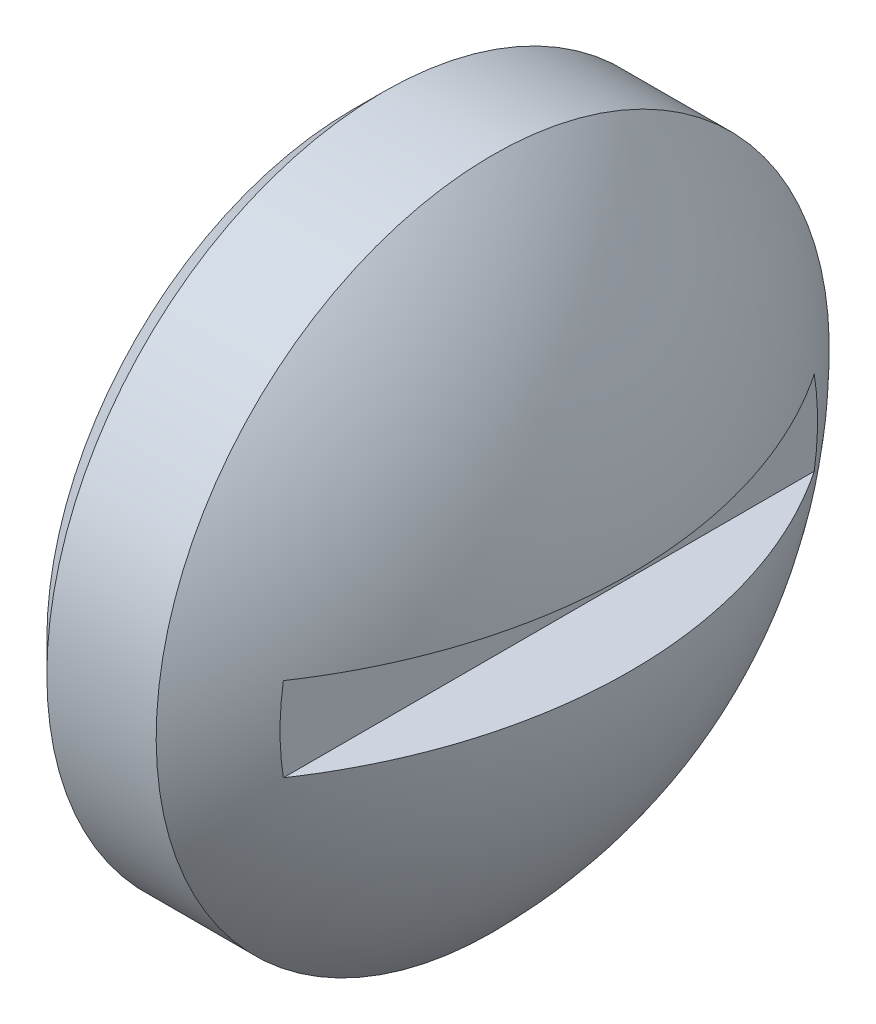
ISO-10303-21;
HEADER;
FILE_DESCRIPTION(('STEP AP214'),'2;1');
FILE_NAME('part.step','',(''),(''),'','','');
FILE_SCHEMA(('AUTOMOTIVE_DESIGN { 1 0 10303 214 1 1 1 1 }'));
ENDSEC;
DATA;
#1=APPLICATION_CONTEXT('core data for automotive mechanical design processes');
#2=APPLICATION_PROTOCOL_DEFINITION('international standard','automotive_design',2000,#1);
#3=PRODUCT_CONTEXT('',#1,'mechanical');
#4=PRODUCT('Part','Part','',(#3));
#5=PRODUCT_RELATED_PRODUCT_CATEGORY('part','',(#4));
#6=PRODUCT_DEFINITION_FORMATION('','',#4);
#7=PRODUCT_DEFINITION_CONTEXT('part definition',#1,'design');
#8=PRODUCT_DEFINITION('design','',#6,#7);
#9=PRODUCT_DEFINITION_SHAPE('','',#8);
#10=(LENGTH_UNIT() NAMED_UNIT(*) SI_UNIT(.MILLI.,.METRE.));
#11=(NAMED_UNIT(*) PLANE_ANGLE_UNIT() SI_UNIT($,.RADIAN.));
#12=(NAMED_UNIT(*) SI_UNIT($,.STERADIAN.) SOLID_ANGLE_UNIT());
#13=UNCERTAINTY_MEASURE_WITH_UNIT(LENGTH_MEASURE(1.E-05),#10,'distance_accuracy_value','');
#14=(GEOMETRIC_REPRESENTATION_CONTEXT(3) GLOBAL_UNCERTAINTY_ASSIGNED_CONTEXT((#13)) GLOBAL_UNIT_ASSIGNED_CONTEXT((#10,
#11,#12)) REPRESENTATION_CONTEXT('',''));
#15=CARTESIAN_POINT('',(0.,0.,0.));
#16=DIRECTION('',(0.,0.,1.));
#17=DIRECTION('',(1.,0.,0.));
#18=AXIS2_PLACEMENT_3D('',#15,#16,#17);
#19=CARTESIAN_POINT('',(-7.0415945787923,0.,0.));
#20=DIRECTION('',(-1.,0.,0.));
#21=DIRECTION('',(0.,1.,0.));
#22=AXIS2_PLACEMENT_3D('',#19,#20,#21);
#23=SPHERICAL_SURFACE('',#22,17.);
#24=CARTESIAN_POINT('',(5.,0.,0.));
#25=DIRECTION('',(-1.,0.,0.));
#26=DIRECTION('',(0.,-1.,0.));
#27=AXIS2_PLACEMENT_3D('',#24,#25,#26);
#28=CIRCLE('',#27,12.);
#29=CARTESIAN_POINT('',(5.00000000000001,-12.,0.));
#30=VERTEX_POINT('',#29);
#31=EDGE_CURVE('E98',#30,#30,#28,.T.);
#32=ORIENTED_EDGE('',*,*,#31,.F.);
#33=EDGE_LOOP('',(#32));
#34=FACE_BOUND('',#33,.T.);
#35=CARTESIAN_POINT('',(-7.0415945787923,1.49999999999999,0.));
#36=DIRECTION('',(0.,-1.,0.));
#37=DIRECTION('',(1.,0.,0.));
#38=AXIS2_PLACEMENT_3D('',#35,#36,#37);
#39=CIRCLE('',#38,16.9336942218761);
#40=CARTESIAN_POINT('',(7.,1.5,-9.46486247574839));
#41=VERTEX_POINT('',#40);
#42=CARTESIAN_POINT('',(7.,1.5,9.46486247574848));
#43=VERTEX_POINT('',#42);
#44=EDGE_CURVE('E71',#41,#43,#39,.T.);
#45=ORIENTED_EDGE('',*,*,#44,.F.);
#46=CARTESIAN_POINT('',(7.,0.,0.));
#47=DIRECTION('',(-1.,0.,0.));
#48=DIRECTION('',(0.,0.,1.));
#49=AXIS2_PLACEMENT_3D('',#46,#47,#48);
#50=CIRCLE('',#49,9.58298605262633);
#51=CARTESIAN_POINT('',(7.,-1.5,-9.46486247574844));
#52=VERTEX_POINT('',#51);
#53=EDGE_CURVE('E80',#41,#52,#50,.T.);
#54=ORIENTED_EDGE('',*,*,#53,.T.);
#55=CARTESIAN_POINT('',(-7.0415945787923,-1.5,0.));
#56=DIRECTION('',(0.,1.,0.));
#57=DIRECTION('',(-1.,0.,0.));
#58=AXIS2_PLACEMENT_3D('',#55,#56,#57);
#59=CIRCLE('',#58,16.9336942218761);
#60=CARTESIAN_POINT('',(7.,-1.5,9.46486247574844));
#61=VERTEX_POINT('',#60);
#62=EDGE_CURVE('E78',#61,#52,#59,.T.);
#63=ORIENTED_EDGE('',*,*,#62,.F.);
#64=EDGE_CURVE('E79',#61,#43,#50,.T.);
#65=ORIENTED_EDGE('',*,*,#64,.T.);
#66=EDGE_LOOP('',(#45,#54,#63,#65));
#67=FACE_BOUND('',#66,.T.);
#68=ADVANCED_FACE('F49',(#34,#67),#23,.T.);
#69=CARTESIAN_POINT('',(0.,7.5,0.));
#70=DIRECTION('',(1.,0.,0.));
#71=DIRECTION('',(0.,1.,0.));
#72=AXIS2_PLACEMENT_3D('',#69,#70,#71);
#73=PLANE('',#72);
#74=CARTESIAN_POINT('',(0.,0.,0.));
#75=DIRECTION('',(1.,0.,0.));
#76=DIRECTION('',(0.,1.,0.));
#77=AXIS2_PLACEMENT_3D('',#74,#75,#76);
#78=CIRCLE('',#77,10.8985);
#79=CARTESIAN_POINT('',(0.,10.8985,0.));
#80=VERTEX_POINT('',#79);
#81=EDGE_CURVE('E57',#80,#80,#78,.F.);
#82=ORIENTED_EDGE('',*,*,#81,.T.);
#83=EDGE_LOOP('',(#82));
#84=FACE_BOUND('',#83,.T.);
#85=CARTESIAN_POINT('',(0.,0.,0.));
#86=DIRECTION('',(-1.,0.,0.));
#87=DIRECTION('',(0.,-1.,0.));
#88=AXIS2_PLACEMENT_3D('',#85,#86,#87);
#89=CIRCLE('',#88,7.5);
#90=CARTESIAN_POINT('',(0.,-7.5,0.));
#91=VERTEX_POINT('',#90);
#92=EDGE_CURVE('E92',#91,#91,#89,.T.);
#93=ORIENTED_EDGE('',*,*,#92,.F.);
#94=EDGE_LOOP('',(#93));
#95=FACE_BOUND('',#94,.T.);
#96=ADVANCED_FACE('F103',(#84,#95),#73,.F.);
#97=CARTESIAN_POINT('',(0.,0.,0.));
#98=DIRECTION('',(-1.,0.,0.));
#99=DIRECTION('',(0.,-1.,0.));
#100=AXIS2_PLACEMENT_3D('',#97,#98,#99);
#101=CYLINDRICAL_SURFACE('',#100,12.);
#102=CARTESIAN_POINT('',(1.10150000000001,0.,0.));
#103=DIRECTION('',(1.,0.,0.));
#104=DIRECTION('',(0.,1.,0.));
#105=AXIS2_PLACEMENT_3D('',#102,#103,#104);
#106=CIRCLE('',#105,12.);
#107=CARTESIAN_POINT('',(1.10150000000001,12.,0.));
#108=VERTEX_POINT('',#107);
#109=EDGE_CURVE('E13',#108,#108,#106,.T.);
#110=ORIENTED_EDGE('',*,*,#109,.T.);
#111=EDGE_LOOP('',(#110));
#112=FACE_BOUND('',#111,.T.);
#113=ORIENTED_EDGE('',*,*,#31,.T.);
#114=EDGE_LOOP('',(#113));
#115=FACE_BOUND('',#114,.T.);
#116=ADVANCED_FACE('F126',(#112,#115),#101,.T.);
#117=CARTESIAN_POINT('',(3.5,7.5,0.));
#118=DIRECTION('',(1.,0.,0.));
#119=DIRECTION('',(0.,1.,0.));
#120=AXIS2_PLACEMENT_3D('',#117,#118,#119);
#121=PLANE('',#120);
#122=CARTESIAN_POINT('',(3.5,0.,0.));
#123=DIRECTION('',(-1.,0.,0.));
#124=DIRECTION('',(0.,-1.,0.));
#125=AXIS2_PLACEMENT_3D('',#122,#123,#124);
#126=CIRCLE('',#125,7.5);
#127=CARTESIAN_POINT('',(3.5,-7.5,0.));
#128=VERTEX_POINT('',#127);
#129=EDGE_CURVE('E95',#128,#128,#126,.T.);
#130=ORIENTED_EDGE('',*,*,#129,.T.);
#131=EDGE_LOOP('',(#130));
#132=FACE_BOUND('',#131,.T.);
#133=ADVANCED_FACE('F116',(#132),#121,.F.);
#134=CARTESIAN_POINT('',(0.,0.,0.));
#135=DIRECTION('',(-1.,0.,0.));
#136=DIRECTION('',(0.,-1.,0.));
#137=AXIS2_PLACEMENT_3D('',#134,#135,#136);
#138=CYLINDRICAL_SURFACE('',#137,7.5);
#139=ORIENTED_EDGE('',*,*,#129,.F.);
#140=EDGE_LOOP('',(#139));
#141=FACE_BOUND('',#140,.T.);
#142=ORIENTED_EDGE('',*,*,#92,.T.);
#143=EDGE_LOOP('',(#142));
#144=FACE_BOUND('',#143,.T.);
#145=ADVANCED_FACE('F108',(#141,#144),#138,.F.);
#146=CARTESIAN_POINT('',(0.,0.,0.));
#147=DIRECTION('',(1.,0.,0.));
#148=DIRECTION('',(0.,1.,0.));
#149=AXIS2_PLACEMENT_3D('',#146,#147,#148);
#150=CONICAL_SURFACE('',#149,10.8985,0.785398163397445);
#151=ORIENTED_EDGE('',*,*,#109,.F.);
#152=EDGE_LOOP('',(#151));
#153=FACE_BOUND('',#152,.T.);
#154=ORIENTED_EDGE('',*,*,#81,.F.);
#155=EDGE_LOOP('',(#154));
#156=FACE_BOUND('',#155,.T.);
#157=ADVANCED_FACE('F51',(#153,#156),#150,.T.);
#158=CARTESIAN_POINT('',(9.89209964308381,1.49999999999999,25.));
#159=DIRECTION('',(0.,-1.,0.));
#160=DIRECTION('',(1.,0.,0.));
#161=AXIS2_PLACEMENT_3D('',#158,#159,#160);
#162=PLANE('',#161);
#163=ORIENTED_EDGE('',*,*,#44,.T.);
#164=DIRECTION('',(0.,0.,1.));
#165=VECTOR('',#164,1.);
#166=CARTESIAN_POINT('',(7.,1.5,25.));
#167=LINE('',#166,#165);
#168=EDGE_CURVE('E64',#41,#43,#167,.T.);
#169=ORIENTED_EDGE('',*,*,#168,.F.);
#170=EDGE_LOOP('',(#163,#169));
#171=FACE_BOUND('',#170,.T.);
#172=ADVANCED_FACE('F107',(#171),#162,.T.);
#173=CARTESIAN_POINT('',(9.89209964308381,-1.5,25.));
#174=DIRECTION('',(0.,1.,0.));
#175=DIRECTION('',(-1.,0.,0.));
#176=AXIS2_PLACEMENT_3D('',#173,#174,#175);
#177=PLANE('',#176);
#178=DIRECTION('',(0.,0.,-1.));
#179=VECTOR('',#178,1.);
#180=CARTESIAN_POINT('',(7.,-1.5,25.));
#181=LINE('',#180,#179);
#182=EDGE_CURVE('E83',#61,#52,#181,.T.);
#183=ORIENTED_EDGE('',*,*,#182,.F.);
#184=ORIENTED_EDGE('',*,*,#62,.T.);
#185=EDGE_LOOP('',(#183,#184));
#186=FACE_BOUND('',#185,.T.);
#187=ADVANCED_FACE('F87',(#186),#177,.T.);
#188=CARTESIAN_POINT('',(7.,0.,0.));
#189=DIRECTION('',(-1.,0.,0.));
#190=DIRECTION('',(0.,-1.,0.));
#191=AXIS2_PLACEMENT_3D('',#188,#189,#190);
#192=PLANE('',#191);
#193=ORIENTED_EDGE('',*,*,#182,.T.);
#194=ORIENTED_EDGE('',*,*,#53,.F.);
#195=ORIENTED_EDGE('',*,*,#168,.T.);
#196=ORIENTED_EDGE('',*,*,#64,.F.);
#197=EDGE_LOOP('',(#193,#194,#195,#196));
#198=FACE_BOUND('',#197,.T.);
#199=ADVANCED_FACE('F85',(#198),#192,.F.);
#200=CLOSED_SHELL('',(#68,#96,#116,#133,#145,#157,#172,#187,#199));
#201=MANIFOLD_SOLID_BREP('B2',#200);
#202=ADVANCED_BREP_SHAPE_REPRESENTATION('',(#18,#201),#14);
#203=SHAPE_DEFINITION_REPRESENTATION(#9,#202);
ENDSEC;
END-ISO-10303-21;
